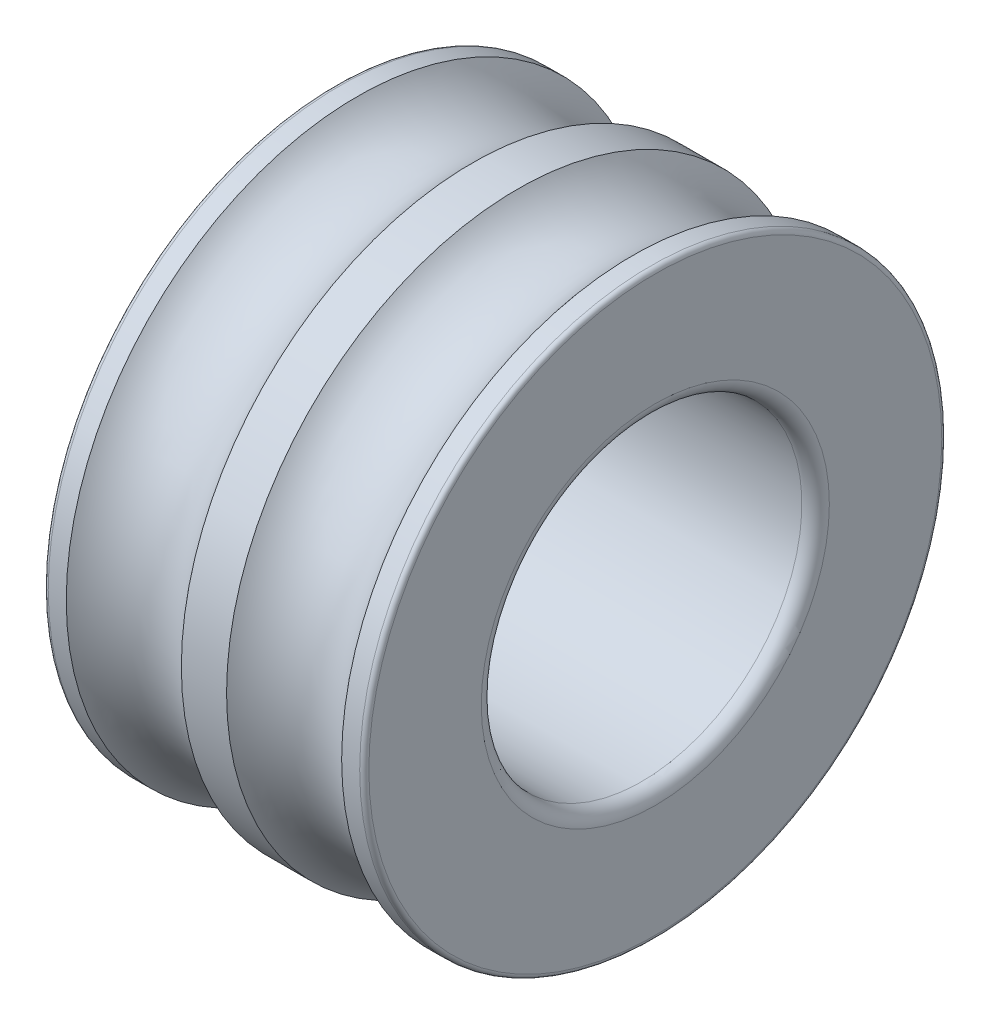
ISO-10303-21;
HEADER;
FILE_DESCRIPTION(('STEP AP214'),'2;1');
FILE_NAME('part.step','',(''),(''),'','','');
FILE_SCHEMA(('AUTOMOTIVE_DESIGN { 1 0 10303 214 1 1 1 1 }'));
ENDSEC;
DATA;
#1=APPLICATION_CONTEXT('core data for automotive mechanical design processes');
#2=APPLICATION_PROTOCOL_DEFINITION('international standard','automotive_design',2000,#1);
#3=PRODUCT_CONTEXT('',#1,'mechanical');
#4=PRODUCT('Part','Part','',(#3));
#5=PRODUCT_RELATED_PRODUCT_CATEGORY('part','',(#4));
#6=PRODUCT_DEFINITION_FORMATION('','',#4);
#7=PRODUCT_DEFINITION_CONTEXT('part definition',#1,'design');
#8=PRODUCT_DEFINITION('design','',#6,#7);
#9=PRODUCT_DEFINITION_SHAPE('','',#8);
#10=(LENGTH_UNIT() NAMED_UNIT(*) SI_UNIT(.MILLI.,.METRE.));
#11=(NAMED_UNIT(*) PLANE_ANGLE_UNIT() SI_UNIT($,.RADIAN.));
#12=(NAMED_UNIT(*) SI_UNIT($,.STERADIAN.) SOLID_ANGLE_UNIT());
#13=UNCERTAINTY_MEASURE_WITH_UNIT(LENGTH_MEASURE(1.E-05),#10,'distance_accuracy_value','');
#14=(GEOMETRIC_REPRESENTATION_CONTEXT(3) GLOBAL_UNCERTAINTY_ASSIGNED_CONTEXT((#13)) GLOBAL_UNIT_ASSIGNED_CONTEXT((#10,
#11,#12)) REPRESENTATION_CONTEXT('',''));
#15=CARTESIAN_POINT('',(0.,0.,0.));
#16=DIRECTION('',(0.,0.,1.));
#17=DIRECTION('',(1.,0.,0.));
#18=AXIS2_PLACEMENT_3D('',#15,#16,#17);
#19=CARTESIAN_POINT('',(0.0999999999999231,0.,0.));
#20=DIRECTION('',(-1.,0.,0.));
#21=DIRECTION('',(0.,0.,1.));
#22=AXIS2_PLACEMENT_3D('',#19,#20,#21);
#23=TOROIDAL_SURFACE('',#22,6.25450000000008,0.0999999999999231);
#24=CARTESIAN_POINT('',(0.,0.,0.));
#25=DIRECTION('',(-1.,0.,0.));
#26=DIRECTION('',(0.,0.,1.));
#27=AXIS2_PLACEMENT_3D('',#24,#25,#26);
#28=CIRCLE('',#27,6.2545);
#29=CARTESIAN_POINT('',(0.,0.,6.2545));
#30=VERTEX_POINT('',#29);
#31=EDGE_CURVE('E10',#30,#30,#28,.T.);
#32=ORIENTED_EDGE('',*,*,#31,.F.);
#33=EDGE_LOOP('',(#32));
#34=FACE_BOUND('',#33,.T.);
#35=CARTESIAN_POINT('',(0.100000000000003,0.,0.));
#36=DIRECTION('',(-1.,0.,0.));
#37=DIRECTION('',(0.,0.,1.));
#38=AXIS2_PLACEMENT_3D('',#35,#36,#37);
#39=CIRCLE('',#38,6.3545);
#40=CARTESIAN_POINT('',(0.100000000000003,0.,6.3545));
#41=VERTEX_POINT('',#40);
#42=EDGE_CURVE('E73',#41,#41,#39,.T.);
#43=ORIENTED_EDGE('',*,*,#42,.T.);
#44=EDGE_LOOP('',(#43));
#45=FACE_BOUND('',#44,.T.);
#46=ADVANCED_FACE('F33',(#34,#45),#23,.T.);
#47=CARTESIAN_POINT('',(0.,6.2545,0.));
#48=DIRECTION('',(1.,0.,0.));
#49=DIRECTION('',(0.,0.,-1.));
#50=AXIS2_PLACEMENT_3D('',#47,#48,#49);
#51=PLANE('',#50);
#52=CARTESIAN_POINT('',(0.,0.,0.));
#53=DIRECTION('',(-1.,0.,0.));
#54=DIRECTION('',(0.,0.,1.));
#55=AXIS2_PLACEMENT_3D('',#52,#53,#54);
#56=CIRCLE('',#55,3.8);
#57=CARTESIAN_POINT('',(0.,0.,3.8));
#58=VERTEX_POINT('',#57);
#59=EDGE_CURVE('E39',#58,#58,#56,.T.);
#60=ORIENTED_EDGE('',*,*,#59,.F.);
#61=EDGE_LOOP('',(#60));
#62=FACE_BOUND('',#61,.T.);
#63=ORIENTED_EDGE('',*,*,#31,.T.);
#64=EDGE_LOOP('',(#63));
#65=FACE_BOUND('',#64,.T.);
#66=ADVANCED_FACE('F134',(#62,#65),#51,.F.);
#67=CARTESIAN_POINT('',(0.299999999999939,0.,0.));
#68=DIRECTION('',(-1.,0.,0.));
#69=DIRECTION('',(0.,0.,1.));
#70=AXIS2_PLACEMENT_3D('',#67,#68,#69);
#71=TOROIDAL_SURFACE('',#70,3.79999999999994,0.299999999999939);
#72=CARTESIAN_POINT('',(0.300000000000002,0.,0.));
#73=DIRECTION('',(-1.,0.,0.));
#74=DIRECTION('',(0.,0.,1.));
#75=AXIS2_PLACEMENT_3D('',#72,#73,#74);
#76=CIRCLE('',#75,3.5);
#77=CARTESIAN_POINT('',(0.300000000000002,0.,3.5));
#78=VERTEX_POINT('',#77);
#79=EDGE_CURVE('E43',#78,#78,#76,.T.);
#80=ORIENTED_EDGE('',*,*,#79,.F.);
#81=EDGE_LOOP('',(#80));
#82=FACE_BOUND('',#81,.T.);
#83=ORIENTED_EDGE('',*,*,#59,.T.);
#84=EDGE_LOOP('',(#83));
#85=FACE_BOUND('',#84,.T.);
#86=ADVANCED_FACE('F129',(#82,#85),#71,.T.);
#87=CARTESIAN_POINT('',(50.,0.,0.));
#88=DIRECTION('',(-1.,0.,0.));
#89=DIRECTION('',(0.,0.,1.));
#90=AXIS2_PLACEMENT_3D('',#87,#88,#89);
#91=CYLINDRICAL_SURFACE('',#90,3.5);
#92=CARTESIAN_POINT('',(6.7,0.,0.));
#93=DIRECTION('',(-1.,0.,0.));
#94=DIRECTION('',(0.,0.,1.));
#95=AXIS2_PLACEMENT_3D('',#92,#93,#94);
#96=CIRCLE('',#95,3.5);
#97=CARTESIAN_POINT('',(6.7,0.,3.5));
#98=VERTEX_POINT('',#97);
#99=EDGE_CURVE('E47',#98,#98,#96,.T.);
#100=ORIENTED_EDGE('',*,*,#99,.F.);
#101=EDGE_LOOP('',(#100));
#102=FACE_BOUND('',#101,.T.);
#103=ORIENTED_EDGE('',*,*,#79,.T.);
#104=EDGE_LOOP('',(#103));
#105=FACE_BOUND('',#104,.T.);
#106=ADVANCED_FACE('F123',(#102,#105),#91,.F.);
#107=CARTESIAN_POINT('',(6.70000000000012,0.,0.));
#108=DIRECTION('',(-1.,0.,0.));
#109=DIRECTION('',(0.,0.,1.));
#110=AXIS2_PLACEMENT_3D('',#107,#108,#109);
#111=TOROIDAL_SURFACE('',#110,3.79999999999988,0.299999999999878);
#112=CARTESIAN_POINT('',(7.,0.,0.));
#113=DIRECTION('',(-1.,0.,0.));
#114=DIRECTION('',(0.,0.,1.));
#115=AXIS2_PLACEMENT_3D('',#112,#113,#114);
#116=CIRCLE('',#115,3.8);
#117=CARTESIAN_POINT('',(7.,0.,3.8));
#118=VERTEX_POINT('',#117);
#119=EDGE_CURVE('E52',#118,#118,#116,.T.);
#120=ORIENTED_EDGE('',*,*,#119,.F.);
#121=EDGE_LOOP('',(#120));
#122=FACE_BOUND('',#121,.T.);
#123=ORIENTED_EDGE('',*,*,#99,.T.);
#124=EDGE_LOOP('',(#123));
#125=FACE_BOUND('',#124,.T.);
#126=ADVANCED_FACE('F117',(#122,#125),#111,.T.);
#127=CARTESIAN_POINT('',(7.,3.8,0.));
#128=DIRECTION('',(-1.,0.,0.));
#129=DIRECTION('',(0.,0.,1.));
#130=AXIS2_PLACEMENT_3D('',#127,#128,#129);
#131=PLANE('',#130);
#132=CARTESIAN_POINT('',(7.,0.,0.));
#133=DIRECTION('',(-1.,0.,0.));
#134=DIRECTION('',(0.,0.,1.));
#135=AXIS2_PLACEMENT_3D('',#132,#133,#134);
#136=CIRCLE('',#135,6.2545);
#137=CARTESIAN_POINT('',(7.,0.,6.2545));
#138=VERTEX_POINT('',#137);
#139=EDGE_CURVE('E55',#138,#138,#136,.T.);
#140=ORIENTED_EDGE('',*,*,#139,.F.);
#141=EDGE_LOOP('',(#140));
#142=FACE_BOUND('',#141,.T.);
#143=ORIENTED_EDGE('',*,*,#119,.T.);
#144=EDGE_LOOP('',(#143));
#145=FACE_BOUND('',#144,.T.);
#146=ADVANCED_FACE('F111',(#142,#145),#131,.F.);
#147=CARTESIAN_POINT('',(6.90000000000015,0.,0.));
#148=DIRECTION('',(-1.,0.,0.));
#149=DIRECTION('',(0.,0.,1.));
#150=AXIS2_PLACEMENT_3D('',#147,#148,#149);
#151=TOROIDAL_SURFACE('',#150,6.25450000000015,0.0999999999998467);
#152=CARTESIAN_POINT('',(6.9,0.,0.));
#153=DIRECTION('',(-1.,0.,0.));
#154=DIRECTION('',(0.,0.,1.));
#155=AXIS2_PLACEMENT_3D('',#152,#153,#154);
#156=CIRCLE('',#155,6.3545);
#157=CARTESIAN_POINT('',(6.9,0.,6.3545));
#158=VERTEX_POINT('',#157);
#159=EDGE_CURVE('E58',#158,#158,#156,.T.);
#160=ORIENTED_EDGE('',*,*,#159,.F.);
#161=EDGE_LOOP('',(#160));
#162=FACE_BOUND('',#161,.T.);
#163=ORIENTED_EDGE('',*,*,#139,.T.);
#164=EDGE_LOOP('',(#163));
#165=FACE_BOUND('',#164,.T.);
#166=ADVANCED_FACE('F105',(#162,#165),#151,.T.);
#167=CARTESIAN_POINT('',(50.,0.,0.));
#168=DIRECTION('',(-1.,0.,0.));
#169=DIRECTION('',(0.,0.,1.));
#170=AXIS2_PLACEMENT_3D('',#167,#168,#169);
#171=CYLINDRICAL_SURFACE('',#170,6.3545);
#172=CARTESIAN_POINT('',(6.5062985314009,0.,0.));
#173=DIRECTION('',(-1.,0.,0.));
#174=DIRECTION('',(0.,0.,1.));
#175=AXIS2_PLACEMENT_3D('',#172,#173,#174);
#176=CIRCLE('',#175,6.3545);
#177=CARTESIAN_POINT('',(6.5062985314009,0.,6.3545));
#178=VERTEX_POINT('',#177);
#179=EDGE_CURVE('E61',#178,#178,#176,.T.);
#180=ORIENTED_EDGE('',*,*,#179,.F.);
#181=EDGE_LOOP('',(#180));
#182=FACE_BOUND('',#181,.T.);
#183=ORIENTED_EDGE('',*,*,#159,.T.);
#184=EDGE_LOOP('',(#183));
#185=FACE_BOUND('',#184,.T.);
#186=ADVANCED_FACE('F99',(#182,#185),#171,.T.);
#187=CARTESIAN_POINT('',(5.25,0.,0.));
#188=DIRECTION('',(-1.,0.,0.));
#189=DIRECTION('',(0.,0.,1.));
#190=AXIS2_PLACEMENT_3D('',#187,#188,#189);
#191=TOROIDAL_SURFACE('',#190,7.32500000000005,1.58750000000005);
#192=CARTESIAN_POINT('',(3.9937014685991,0.,0.));
#193=DIRECTION('',(-1.,0.,0.));
#194=DIRECTION('',(0.,0.,1.));
#195=AXIS2_PLACEMENT_3D('',#192,#193,#194);
#196=CIRCLE('',#195,6.3545);
#197=CARTESIAN_POINT('',(3.9937014685991,0.,6.3545));
#198=VERTEX_POINT('',#197);
#199=EDGE_CURVE('E64',#198,#198,#196,.T.);
#200=ORIENTED_EDGE('',*,*,#199,.F.);
#201=EDGE_LOOP('',(#200));
#202=FACE_BOUND('',#201,.T.);
#203=ORIENTED_EDGE('',*,*,#179,.T.);
#204=EDGE_LOOP('',(#203));
#205=FACE_BOUND('',#204,.T.);
#206=ADVANCED_FACE('F93',(#202,#205),#191,.F.);
#207=CARTESIAN_POINT('',(50.,0.,0.));
#208=DIRECTION('',(-1.,0.,0.));
#209=DIRECTION('',(0.,0.,1.));
#210=AXIS2_PLACEMENT_3D('',#207,#208,#209);
#211=CYLINDRICAL_SURFACE('',#210,6.3545);
#212=CARTESIAN_POINT('',(3.0062985314009,0.,0.));
#213=DIRECTION('',(-1.,0.,0.));
#214=DIRECTION('',(0.,0.,1.));
#215=AXIS2_PLACEMENT_3D('',#212,#213,#214);
#216=CIRCLE('',#215,6.3545);
#217=CARTESIAN_POINT('',(3.0062985314009,0.,6.3545));
#218=VERTEX_POINT('',#217);
#219=EDGE_CURVE('E67',#218,#218,#216,.T.);
#220=ORIENTED_EDGE('',*,*,#219,.F.);
#221=EDGE_LOOP('',(#220));
#222=FACE_BOUND('',#221,.T.);
#223=ORIENTED_EDGE('',*,*,#199,.T.);
#224=EDGE_LOOP('',(#223));
#225=FACE_BOUND('',#224,.T.);
#226=ADVANCED_FACE('F87',(#222,#225),#211,.T.);
#227=CARTESIAN_POINT('',(1.75000000000001,0.,0.));
#228=DIRECTION('',(-1.,0.,0.));
#229=DIRECTION('',(0.,0.,1.));
#230=AXIS2_PLACEMENT_3D('',#227,#228,#229);
#231=TOROIDAL_SURFACE('',#230,7.32500000000003,1.58750000000003);
#232=CARTESIAN_POINT('',(0.493701468599117,0.,0.));
#233=DIRECTION('',(-1.,0.,0.));
#234=DIRECTION('',(0.,0.,1.));
#235=AXIS2_PLACEMENT_3D('',#232,#233,#234);
#236=CIRCLE('',#235,6.3545);
#237=CARTESIAN_POINT('',(0.493701468599117,0.,6.3545));
#238=VERTEX_POINT('',#237);
#239=EDGE_CURVE('E70',#238,#238,#236,.T.);
#240=ORIENTED_EDGE('',*,*,#239,.F.);
#241=EDGE_LOOP('',(#240));
#242=FACE_BOUND('',#241,.T.);
#243=ORIENTED_EDGE('',*,*,#219,.T.);
#244=EDGE_LOOP('',(#243));
#245=FACE_BOUND('',#244,.T.);
#246=ADVANCED_FACE('F81',(#242,#245),#231,.F.);
#247=CARTESIAN_POINT('',(50.,0.,0.));
#248=DIRECTION('',(-1.,0.,0.));
#249=DIRECTION('',(0.,0.,1.));
#250=AXIS2_PLACEMENT_3D('',#247,#248,#249);
#251=CYLINDRICAL_SURFACE('',#250,6.3545);
#252=ORIENTED_EDGE('',*,*,#42,.F.);
#253=EDGE_LOOP('',(#252));
#254=FACE_BOUND('',#253,.T.);
#255=ORIENTED_EDGE('',*,*,#239,.T.);
#256=EDGE_LOOP('',(#255));
#257=FACE_BOUND('',#256,.T.);
#258=ADVANCED_FACE('F78',(#254,#257),#251,.T.);
#259=CLOSED_SHELL('',(#46,#66,#86,#106,#126,#146,#166,#186,#206,#226,#246,#258));
#260=MANIFOLD_SOLID_BREP('B2',#259);
#261=ADVANCED_BREP_SHAPE_REPRESENTATION('',(#18,#260),#14);
#262=SHAPE_DEFINITION_REPRESENTATION(#9,#261);
ENDSEC;
END-ISO-10303-21;
